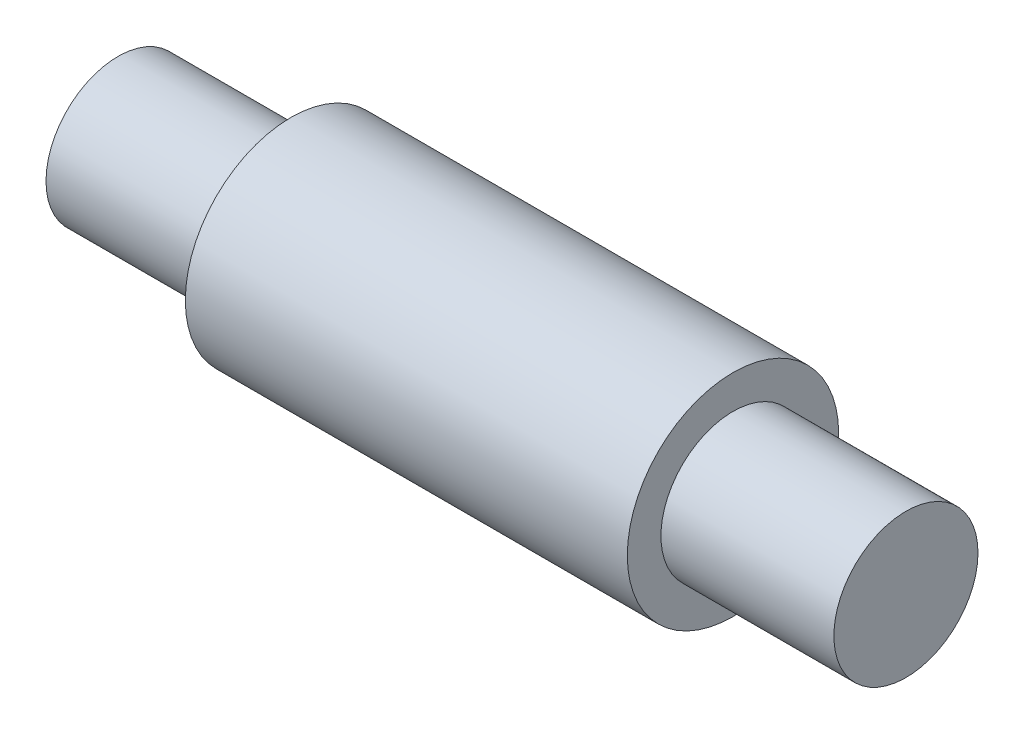
ISO-10303-21;
HEADER;
FILE_DESCRIPTION(('STEP AP214'),'2;1');
FILE_NAME('part.step','',(''),(''),'','','');
FILE_SCHEMA(('AUTOMOTIVE_DESIGN { 1 0 10303 214 1 1 1 1 }'));
ENDSEC;
DATA;
#1=APPLICATION_CONTEXT('core data for automotive mechanical design processes');
#2=APPLICATION_PROTOCOL_DEFINITION('international standard','automotive_design',2000,#1);
#3=PRODUCT_CONTEXT('',#1,'mechanical');
#4=PRODUCT('Part','Part','',(#3));
#5=PRODUCT_RELATED_PRODUCT_CATEGORY('part','',(#4));
#6=PRODUCT_DEFINITION_FORMATION('','',#4);
#7=PRODUCT_DEFINITION_CONTEXT('part definition',#1,'design');
#8=PRODUCT_DEFINITION('design','',#6,#7);
#9=PRODUCT_DEFINITION_SHAPE('','',#8);
#10=(LENGTH_UNIT() NAMED_UNIT(*) SI_UNIT(.MILLI.,.METRE.));
#11=(NAMED_UNIT(*) PLANE_ANGLE_UNIT() SI_UNIT($,.RADIAN.));
#12=(NAMED_UNIT(*) SI_UNIT($,.STERADIAN.) SOLID_ANGLE_UNIT());
#13=UNCERTAINTY_MEASURE_WITH_UNIT(LENGTH_MEASURE(1.E-05),#10,'distance_accuracy_value','');
#14=(GEOMETRIC_REPRESENTATION_CONTEXT(3) GLOBAL_UNCERTAINTY_ASSIGNED_CONTEXT((#13)) GLOBAL_UNIT_ASSIGNED_CONTEXT((#10,
#11,#12)) REPRESENTATION_CONTEXT('',''));
#15=CARTESIAN_POINT('',(0.,0.,0.));
#16=DIRECTION('',(0.,0.,1.));
#17=DIRECTION('',(1.,0.,0.));
#18=AXIS2_PLACEMENT_3D('',#15,#16,#17);
#19=CARTESIAN_POINT('',(46.,0.,0.));
#20=DIRECTION('',(-1.,0.,0.));
#21=DIRECTION('',(0.,0.,1.));
#22=AXIS2_PLACEMENT_3D('',#19,#20,#21);
#23=CYLINDRICAL_SURFACE('',#22,11.);
#24=CARTESIAN_POINT('',(46.,0.,0.));
#25=DIRECTION('',(1.,0.,0.));
#26=DIRECTION('',(0.,0.,-1.));
#27=AXIS2_PLACEMENT_3D('',#24,#25,#26);
#28=CIRCLE('',#27,11.);
#29=CARTESIAN_POINT('',(46.,0.,-11.));
#30=VERTEX_POINT('',#29);
#31=EDGE_CURVE('E55',#30,#30,#28,.T.);
#32=ORIENTED_EDGE('',*,*,#31,.F.);
#33=EDGE_LOOP('',(#32));
#34=FACE_BOUND('',#33,.T.);
#35=CARTESIAN_POINT('',(0.,0.,0.));
#36=DIRECTION('',(1.,0.,0.));
#37=DIRECTION('',(0.,0.,-1.));
#38=AXIS2_PLACEMENT_3D('',#35,#36,#37);
#39=CIRCLE('',#38,11.);
#40=CARTESIAN_POINT('',(0.,0.,-11.));
#41=VERTEX_POINT('',#40);
#42=EDGE_CURVE('E44',#41,#41,#39,.T.);
#43=ORIENTED_EDGE('',*,*,#42,.T.);
#44=EDGE_LOOP('',(#43));
#45=FACE_BOUND('',#44,.T.);
#46=ADVANCED_FACE('F41',(#34,#45),#23,.T.);
#47=CARTESIAN_POINT('',(46.,0.,0.));
#48=DIRECTION('',(1.,0.,0.));
#49=DIRECTION('',(0.,0.,-1.));
#50=AXIS2_PLACEMENT_3D('',#47,#48,#49);
#51=PLANE('',#50);
#52=CARTESIAN_POINT('',(46.,0.,0.));
#53=DIRECTION('',(1.,0.,0.));
#54=DIRECTION('',(0.,0.,-1.));
#55=AXIS2_PLACEMENT_3D('',#52,#53,#54);
#56=CIRCLE('',#55,7.5);
#57=CARTESIAN_POINT('',(46.,0.,-7.5));
#58=VERTEX_POINT('',#57);
#59=EDGE_CURVE('E49',#58,#58,#56,.T.);
#60=ORIENTED_EDGE('',*,*,#59,.F.);
#61=EDGE_LOOP('',(#60));
#62=FACE_BOUND('',#61,.T.);
#63=ORIENTED_EDGE('',*,*,#31,.T.);
#64=EDGE_LOOP('',(#63));
#65=FACE_BOUND('',#64,.T.);
#66=ADVANCED_FACE('F75',(#62,#65),#51,.T.);
#67=CARTESIAN_POINT('',(0.,0.,0.));
#68=DIRECTION('',(1.,0.,0.));
#69=DIRECTION('',(0.,0.,-1.));
#70=AXIS2_PLACEMENT_3D('',#67,#68,#69);
#71=PLANE('',#70);
#72=CARTESIAN_POINT('',(0.,0.,0.));
#73=DIRECTION('',(-1.,0.,0.));
#74=DIRECTION('',(0.,0.,1.));
#75=AXIS2_PLACEMENT_3D('',#72,#73,#74);
#76=CIRCLE('',#75,7.5);
#77=CARTESIAN_POINT('',(0.,0.,7.5));
#78=VERTEX_POINT('',#77);
#79=EDGE_CURVE('E10',#78,#78,#76,.T.);
#80=ORIENTED_EDGE('',*,*,#79,.F.);
#81=EDGE_LOOP('',(#80));
#82=FACE_BOUND('',#81,.T.);
#83=ORIENTED_EDGE('',*,*,#42,.F.);
#84=EDGE_LOOP('',(#83));
#85=FACE_BOUND('',#84,.T.);
#86=ADVANCED_FACE('F72',(#82,#85),#71,.F.);
#87=CARTESIAN_POINT('',(64.,0.,0.));
#88=DIRECTION('',(-1.,0.,0.));
#89=DIRECTION('',(0.,0.,1.));
#90=AXIS2_PLACEMENT_3D('',#87,#88,#89);
#91=CYLINDRICAL_SURFACE('',#90,7.5);
#92=CARTESIAN_POINT('',(64.,0.,0.));
#93=DIRECTION('',(1.,0.,0.));
#94=DIRECTION('',(0.,0.,-1.));
#95=AXIS2_PLACEMENT_3D('',#92,#93,#94);
#96=CIRCLE('',#95,7.5);
#97=CARTESIAN_POINT('',(64.,0.,-7.5));
#98=VERTEX_POINT('',#97);
#99=EDGE_CURVE('E60',#98,#98,#96,.T.);
#100=ORIENTED_EDGE('',*,*,#99,.F.);
#101=EDGE_LOOP('',(#100));
#102=FACE_BOUND('',#101,.T.);
#103=ORIENTED_EDGE('',*,*,#59,.T.);
#104=EDGE_LOOP('',(#103));
#105=FACE_BOUND('',#104,.T.);
#106=ADVANCED_FACE('F74',(#102,#105),#91,.T.);
#107=CARTESIAN_POINT('',(64.,0.,0.));
#108=DIRECTION('',(1.,0.,0.));
#109=DIRECTION('',(0.,0.,-1.));
#110=AXIS2_PLACEMENT_3D('',#107,#108,#109);
#111=PLANE('',#110);
#112=ORIENTED_EDGE('',*,*,#99,.T.);
#113=EDGE_LOOP('',(#112));
#114=FACE_BOUND('',#113,.T.);
#115=ADVANCED_FACE('F81',(#114),#111,.T.);
#116=CARTESIAN_POINT('',(-18.,0.,0.));
#117=DIRECTION('',(1.,0.,0.));
#118=DIRECTION('',(0.,0.,-1.));
#119=AXIS2_PLACEMENT_3D('',#116,#117,#118);
#120=CYLINDRICAL_SURFACE('',#119,7.5);
#121=CARTESIAN_POINT('',(-18.,0.,0.));
#122=DIRECTION('',(-1.,0.,0.));
#123=DIRECTION('',(0.,0.,1.));
#124=AXIS2_PLACEMENT_3D('',#121,#122,#123);
#125=CIRCLE('',#124,7.5);
#126=CARTESIAN_POINT('',(-18.,0.,7.5));
#127=VERTEX_POINT('',#126);
#128=EDGE_CURVE('E59',#127,#127,#125,.T.);
#129=ORIENTED_EDGE('',*,*,#128,.F.);
#130=EDGE_LOOP('',(#129));
#131=FACE_BOUND('',#130,.T.);
#132=ORIENTED_EDGE('',*,*,#79,.T.);
#133=EDGE_LOOP('',(#132));
#134=FACE_BOUND('',#133,.T.);
#135=ADVANCED_FACE('F111',(#131,#134),#120,.T.);
#136=CARTESIAN_POINT('',(-18.,0.,0.));
#137=DIRECTION('',(-1.,0.,0.));
#138=DIRECTION('',(0.,0.,1.));
#139=AXIS2_PLACEMENT_3D('',#136,#137,#138);
#140=PLANE('',#139);
#141=ORIENTED_EDGE('',*,*,#128,.T.);
#142=EDGE_LOOP('',(#141));
#143=FACE_BOUND('',#142,.T.);
#144=ADVANCED_FACE('F127',(#143),#140,.T.);
#145=CLOSED_SHELL('',(#46,#66,#86,#106,#115,#135,#144));
#146=MANIFOLD_SOLID_BREP('B2',#145);
#147=ADVANCED_BREP_SHAPE_REPRESENTATION('',(#18,#146),#14);
#148=SHAPE_DEFINITION_REPRESENTATION(#9,#147);
ENDSEC;
END-ISO-10303-21;
